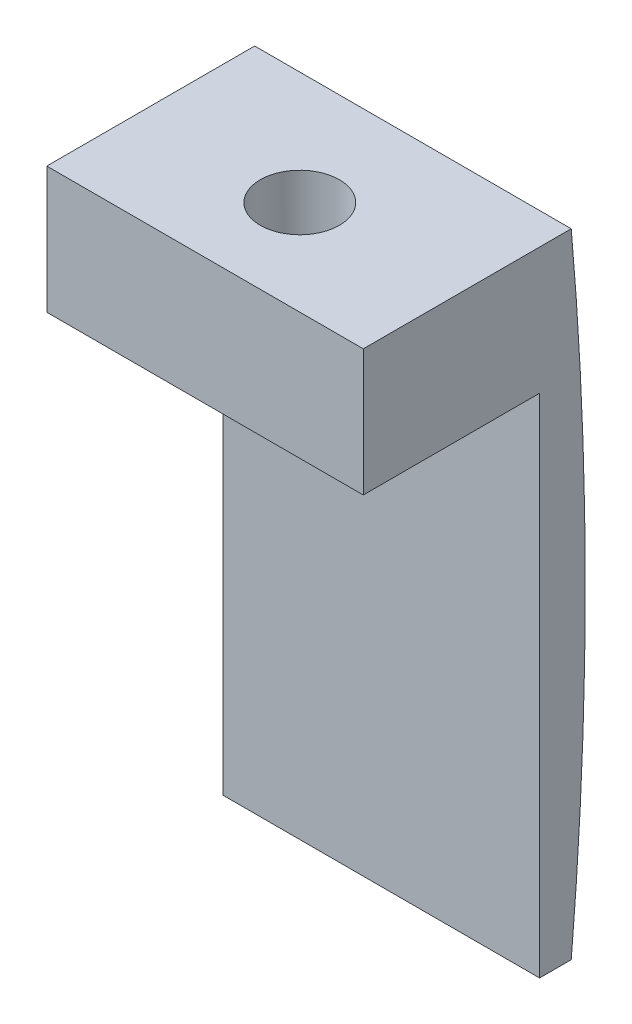
ISO-10303-21;
HEADER;
FILE_DESCRIPTION(('STEP AP214'),'2;1');
FILE_NAME('part.step','',(''),(''),'','','');
FILE_SCHEMA(('AUTOMOTIVE_DESIGN { 1 0 10303 214 1 1 1 1 }'));
ENDSEC;
DATA;
#1=APPLICATION_CONTEXT('core data for automotive mechanical design processes');
#2=APPLICATION_PROTOCOL_DEFINITION('international standard','automotive_design',2000,#1);
#3=PRODUCT_CONTEXT('',#1,'mechanical');
#4=PRODUCT('Part','Part','',(#3));
#5=PRODUCT_RELATED_PRODUCT_CATEGORY('part','',(#4));
#6=PRODUCT_DEFINITION_FORMATION('','',#4);
#7=PRODUCT_DEFINITION_CONTEXT('part definition',#1,'design');
#8=PRODUCT_DEFINITION('design','',#6,#7);
#9=PRODUCT_DEFINITION_SHAPE('','',#8);
#10=(LENGTH_UNIT() NAMED_UNIT(*) SI_UNIT(.MILLI.,.METRE.));
#11=(NAMED_UNIT(*) PLANE_ANGLE_UNIT() SI_UNIT($,.RADIAN.));
#12=(NAMED_UNIT(*) SI_UNIT($,.STERADIAN.) SOLID_ANGLE_UNIT());
#13=UNCERTAINTY_MEASURE_WITH_UNIT(LENGTH_MEASURE(1.E-05),#10,'distance_accuracy_value','');
#14=(GEOMETRIC_REPRESENTATION_CONTEXT(3) GLOBAL_UNCERTAINTY_ASSIGNED_CONTEXT((#13)) GLOBAL_UNIT_ASSIGNED_CONTEXT((#10,
#11,#12)) REPRESENTATION_CONTEXT('',''));
#15=CARTESIAN_POINT('',(0.,0.,0.));
#16=DIRECTION('',(0.,0.,1.));
#17=DIRECTION('',(1.,0.,0.));
#18=AXIS2_PLACEMENT_3D('',#15,#16,#17);
#19=CARTESIAN_POINT('',(10.,3.25815389785774,0.637092305107113));
#20=DIRECTION('',(0.,0.,-1.));
#21=DIRECTION('',(0.,1.,0.));
#22=AXIS2_PLACEMENT_3D('',#19,#20,#21);
#23=PLANE('',#22);
#24=DIRECTION('',(0.,-1.,0.));
#25=VECTOR('',#24,1.);
#26=CARTESIAN_POINT('',(0.,3.25815389785774,0.637092305107113));
#27=LINE('',#26,#25);
#28=CARTESIAN_POINT('',(0.,3.25815389785774,0.637092305107113));
#29=VERTEX_POINT('',#28);
#30=CARTESIAN_POINT('',(0.,-12.7418461021423,0.637092305107111));
#31=VERTEX_POINT('',#30);
#32=EDGE_CURVE('E116',#29,#31,#27,.T.);
#33=ORIENTED_EDGE('',*,*,#32,.T.);
#34=DIRECTION('',(-1.,0.,0.));
#35=VECTOR('',#34,1.);
#36=CARTESIAN_POINT('',(10.,-12.7418461021423,0.637092305107111));
#37=LINE('',#36,#35);
#38=CARTESIAN_POINT('',(10.,-12.7418461021423,0.637092305107111));
#39=VERTEX_POINT('',#38);
#40=EDGE_CURVE('E11',#39,#31,#37,.T.);
#41=ORIENTED_EDGE('',*,*,#40,.F.);
#42=DIRECTION('',(0.,-1.,0.));
#43=VECTOR('',#42,1.);
#44=CARTESIAN_POINT('',(10.,3.25815389785774,0.637092305107113));
#45=LINE('',#44,#43);
#46=CARTESIAN_POINT('',(10.,3.25815389785774,0.637092305107113));
#47=VERTEX_POINT('',#46);
#48=EDGE_CURVE('E125',#47,#39,#45,.T.);
#49=ORIENTED_EDGE('',*,*,#48,.F.);
#50=DIRECTION('',(-1.,0.,0.));
#51=VECTOR('',#50,1.);
#52=CARTESIAN_POINT('',(10.,3.25815389785774,0.637092305107113));
#53=LINE('',#52,#51);
#54=EDGE_CURVE('E112',#47,#29,#53,.T.);
#55=ORIENTED_EDGE('',*,*,#54,.T.);
#56=EDGE_LOOP('',(#33,#41,#49,#55));
#57=FACE_BOUND('',#56,.T.);
#58=ADVANCED_FACE('F33',(#57),#23,.F.);
#59=CARTESIAN_POINT('',(10.,-12.7418461021423,-0.362907694892889));
#60=DIRECTION('',(0.,1.,0.));
#61=DIRECTION('',(0.,0.,1.));
#62=AXIS2_PLACEMENT_3D('',#59,#60,#61);
#63=PLANE('',#62);
#64=DIRECTION('',(0.,0.,-1.));
#65=VECTOR('',#64,1.);
#66=CARTESIAN_POINT('',(0.,-12.7418461021423,-0.362907694892889));
#67=LINE('',#66,#65);
#68=CARTESIAN_POINT('',(0.,-12.7418461021423,-0.362907694892889));
#69=VERTEX_POINT('',#68);
#70=EDGE_CURVE('E119',#31,#69,#67,.T.);
#71=ORIENTED_EDGE('',*,*,#70,.T.);
#72=DIRECTION('',(-1.,0.,0.));
#73=VECTOR('',#72,1.);
#74=CARTESIAN_POINT('',(10.,-12.7418461021423,-0.362907694892889));
#75=LINE('',#74,#73);
#76=CARTESIAN_POINT('',(10.,-12.7418461021423,-0.362907694892889));
#77=VERTEX_POINT('',#76);
#78=EDGE_CURVE('E41',#77,#69,#75,.T.);
#79=ORIENTED_EDGE('',*,*,#78,.F.);
#80=DIRECTION('',(0.,0.,-1.));
#81=VECTOR('',#80,1.);
#82=CARTESIAN_POINT('',(10.,-12.7418461021423,-0.362907694892889));
#83=LINE('',#82,#81);
#84=EDGE_CURVE('E84',#39,#77,#83,.T.);
#85=ORIENTED_EDGE('',*,*,#84,.F.);
#86=ORIENTED_EDGE('',*,*,#40,.T.);
#87=EDGE_LOOP('',(#71,#79,#85,#86));
#88=FACE_BOUND('',#87,.T.);
#89=ADVANCED_FACE('F148',(#88),#63,.F.);
#90=CARTESIAN_POINT('',(10.,7.25815389785774,0.206723568871745));
#91=DIRECTION('',(0.,-1.,0.));
#92=DIRECTION('',(0.,0.,-1.));
#93=AXIS2_PLACEMENT_3D('',#90,#91,#92);
#94=PLANE('',#93);
#95=CARTESIAN_POINT('',(4.99500919662601,7.25815389785774,3.20672356887174));
#96=DIRECTION('',(0.,-1.,0.));
#97=DIRECTION('',(0.,0.,-1.));
#98=AXIS2_PLACEMENT_3D('',#95,#96,#97);
#99=CIRCLE('',#98,1.25);
#100=CARTESIAN_POINT('',(4.99500919662601,7.25815389785774,1.95672356887174));
#101=VERTEX_POINT('',#100);
#102=EDGE_CURVE('E120',#101,#101,#99,.T.);
#103=ORIENTED_EDGE('',*,*,#102,.T.);
#104=EDGE_LOOP('',(#103));
#105=FACE_BOUND('',#104,.T.);
#106=DIRECTION('',(0.,0.,1.));
#107=VECTOR('',#106,1.);
#108=CARTESIAN_POINT('',(0.,7.25815389785774,0.206723568871745));
#109=LINE('',#108,#107);
#110=CARTESIAN_POINT('',(0.,7.25815389785774,-0.362907694892886));
#111=VERTEX_POINT('',#110);
#112=CARTESIAN_POINT('',(0.,7.25815389785774,6.20672356887175));
#113=VERTEX_POINT('',#112);
#114=EDGE_CURVE('E106',#111,#113,#109,.T.);
#115=ORIENTED_EDGE('',*,*,#114,.T.);
#116=DIRECTION('',(-1.,0.,0.));
#117=VECTOR('',#116,1.);
#118=CARTESIAN_POINT('',(10.,7.25815389785774,6.20672356887175));
#119=LINE('',#118,#117);
#120=CARTESIAN_POINT('',(10.,7.25815389785774,6.20672356887175));
#121=VERTEX_POINT('',#120);
#122=EDGE_CURVE('E103',#121,#113,#119,.T.);
#123=ORIENTED_EDGE('',*,*,#122,.F.);
#124=DIRECTION('',(0.,0.,1.));
#125=VECTOR('',#124,1.);
#126=CARTESIAN_POINT('',(10.,7.25815389785774,-0.362907694892886));
#127=LINE('',#126,#125);
#128=CARTESIAN_POINT('',(10.,7.25815389785774,-0.362907694892886));
#129=VERTEX_POINT('',#128);
#130=EDGE_CURVE('E92',#129,#121,#127,.T.);
#131=ORIENTED_EDGE('',*,*,#130,.F.);
#132=DIRECTION('',(-1.,0.,0.));
#133=VECTOR('',#132,1.);
#134=CARTESIAN_POINT('',(10.,7.25815389785774,-0.362907694892886));
#135=LINE('',#134,#133);
#136=EDGE_CURVE('E107',#129,#111,#135,.T.);
#137=ORIENTED_EDGE('',*,*,#136,.T.);
#138=EDGE_LOOP('',(#115,#123,#131,#137));
#139=FACE_BOUND('',#138,.T.);
#140=ADVANCED_FACE('F104',(#105,#139),#94,.F.);
#141=CARTESIAN_POINT('',(10.,7.25815389785774,6.20672356887175));
#142=DIRECTION('',(0.,0.,-1.));
#143=DIRECTION('',(0.,1.,0.));
#144=AXIS2_PLACEMENT_3D('',#141,#142,#143);
#145=PLANE('',#144);
#146=DIRECTION('',(0.,-1.,0.));
#147=VECTOR('',#146,1.);
#148=CARTESIAN_POINT('',(0.,7.25815389785774,6.20672356887175));
#149=LINE('',#148,#147);
#150=CARTESIAN_POINT('',(0.,3.25815389785774,6.20672356887174));
#151=VERTEX_POINT('',#150);
#152=EDGE_CURVE('E70',#113,#151,#149,.T.);
#153=ORIENTED_EDGE('',*,*,#152,.T.);
#154=DIRECTION('',(-1.,0.,0.));
#155=VECTOR('',#154,1.);
#156=CARTESIAN_POINT('',(10.,3.25815389785774,6.20672356887174));
#157=LINE('',#156,#155);
#158=CARTESIAN_POINT('',(10.,3.25815389785774,6.20672356887174));
#159=VERTEX_POINT('',#158);
#160=EDGE_CURVE('E108',#159,#151,#157,.T.);
#161=ORIENTED_EDGE('',*,*,#160,.F.);
#162=DIRECTION('',(0.,-1.,0.));
#163=VECTOR('',#162,1.);
#164=CARTESIAN_POINT('',(10.,7.25815389785774,6.20672356887175));
#165=LINE('',#164,#163);
#166=EDGE_CURVE('E96',#121,#159,#165,.T.);
#167=ORIENTED_EDGE('',*,*,#166,.F.);
#168=ORIENTED_EDGE('',*,*,#122,.T.);
#169=EDGE_LOOP('',(#153,#161,#167,#168));
#170=FACE_BOUND('',#169,.T.);
#171=ADVANCED_FACE('F110',(#170),#145,.F.);
#172=CARTESIAN_POINT('',(10.,3.25815389785774,0.637092305107113));
#173=DIRECTION('',(0.,1.,0.));
#174=DIRECTION('',(0.,0.,1.));
#175=AXIS2_PLACEMENT_3D('',#172,#173,#174);
#176=PLANE('',#175);
#177=CARTESIAN_POINT('',(4.99500919662601,3.25815389785774,3.20672356887174));
#178=DIRECTION('',(0.,1.,0.));
#179=DIRECTION('',(0.,0.,1.));
#180=AXIS2_PLACEMENT_3D('',#177,#178,#179);
#181=CIRCLE('',#180,1.25);
#182=CARTESIAN_POINT('',(4.99500919662601,3.25815389785774,4.45672356887174));
#183=VERTEX_POINT('',#182);
#184=EDGE_CURVE('E138',#183,#183,#181,.T.);
#185=ORIENTED_EDGE('',*,*,#184,.T.);
#186=EDGE_LOOP('',(#185));
#187=FACE_BOUND('',#186,.T.);
#188=DIRECTION('',(0.,0.,-1.));
#189=VECTOR('',#188,1.);
#190=CARTESIAN_POINT('',(0.,3.25815389785774,0.637092305107113));
#191=LINE('',#190,#189);
#192=EDGE_CURVE('E76',#151,#29,#191,.T.);
#193=ORIENTED_EDGE('',*,*,#192,.T.);
#194=ORIENTED_EDGE('',*,*,#54,.F.);
#195=DIRECTION('',(0.,0.,-1.));
#196=VECTOR('',#195,1.);
#197=CARTESIAN_POINT('',(10.,3.25815389785774,0.637092305107113));
#198=LINE('',#197,#196);
#199=EDGE_CURVE('E49',#159,#47,#198,.T.);
#200=ORIENTED_EDGE('',*,*,#199,.F.);
#201=ORIENTED_EDGE('',*,*,#160,.T.);
#202=EDGE_LOOP('',(#193,#194,#200,#201));
#203=FACE_BOUND('',#202,.T.);
#204=ADVANCED_FACE('F159',(#187,#203),#176,.F.);
#205=CARTESIAN_POINT('',(10.,0.,0.));
#206=DIRECTION('',(-1.,0.,0.));
#207=DIRECTION('',(0.,0.,1.));
#208=AXIS2_PLACEMENT_3D('',#205,#206,#207);
#209=PLANE('',#208);
#210=ORIENTED_EDGE('',*,*,#48,.T.);
#211=ORIENTED_EDGE('',*,*,#84,.T.);
#212=CARTESIAN_POINT('',(10.,-2.74184610214227,112.40605079678));
#213=DIRECTION('',(-1.,0.,0.));
#214=DIRECTION('',(0.,0.,1.));
#215=AXIS2_PLACEMENT_3D('',#212,#213,#214);
#216=CIRCLE('',#215,113.211474680337);
#217=EDGE_CURVE('E98',#77,#129,#216,.F.);
#218=ORIENTED_EDGE('',*,*,#217,.T.);
#219=ORIENTED_EDGE('',*,*,#130,.T.);
#220=ORIENTED_EDGE('',*,*,#166,.T.);
#221=ORIENTED_EDGE('',*,*,#199,.T.);
#222=EDGE_LOOP('',(#210,#211,#218,#219,#220,#221));
#223=FACE_BOUND('',#222,.T.);
#224=ADVANCED_FACE('F94',(#223),#209,.F.);
#225=CARTESIAN_POINT('',(0.,0.,0.));
#226=DIRECTION('',(-1.,0.,0.));
#227=DIRECTION('',(0.,0.,1.));
#228=AXIS2_PLACEMENT_3D('',#225,#226,#227);
#229=PLANE('',#228);
#230=ORIENTED_EDGE('',*,*,#32,.F.);
#231=ORIENTED_EDGE('',*,*,#192,.F.);
#232=ORIENTED_EDGE('',*,*,#152,.F.);
#233=ORIENTED_EDGE('',*,*,#114,.F.);
#234=CARTESIAN_POINT('',(0.,-2.74184610214227,112.40605079678));
#235=DIRECTION('',(-1.,0.,0.));
#236=DIRECTION('',(0.,0.,1.));
#237=AXIS2_PLACEMENT_3D('',#234,#235,#236);
#238=CIRCLE('',#237,113.211474680337);
#239=EDGE_CURVE('E133',#111,#69,#238,.T.);
#240=ORIENTED_EDGE('',*,*,#239,.T.);
#241=ORIENTED_EDGE('',*,*,#70,.F.);
#242=EDGE_LOOP('',(#230,#231,#232,#233,#240,#241));
#243=FACE_BOUND('',#242,.T.);
#244=ADVANCED_FACE('F136',(#243),#229,.T.);
#245=CARTESIAN_POINT('',(4.99500919662601,10.7936878037905,3.20672356887174));
#246=DIRECTION('',(0.,-1.,0.));
#247=DIRECTION('',(0.,0.,-1.));
#248=AXIS2_PLACEMENT_3D('',#245,#246,#247);
#249=CYLINDRICAL_SURFACE('',#248,1.25);
#250=ORIENTED_EDGE('',*,*,#102,.F.);
#251=EDGE_LOOP('',(#250));
#252=FACE_BOUND('',#251,.T.);
#253=ORIENTED_EDGE('',*,*,#184,.F.);
#254=EDGE_LOOP('',(#253));
#255=FACE_BOUND('',#254,.T.);
#256=ADVANCED_FACE('F165',(#252,#255),#249,.F.);
#257=CARTESIAN_POINT('',(30.0048949154258,-2.74184610214227,112.40605079678));
#258=DIRECTION('',(-1.,0.,0.));
#259=DIRECTION('',(0.,0.,1.));
#260=AXIS2_PLACEMENT_3D('',#257,#258,#259);
#261=CYLINDRICAL_SURFACE('',#260,113.211474680337);
#262=ORIENTED_EDGE('',*,*,#217,.F.);
#263=ORIENTED_EDGE('',*,*,#78,.T.);
#264=ORIENTED_EDGE('',*,*,#239,.F.);
#265=ORIENTED_EDGE('',*,*,#136,.F.);
#266=EDGE_LOOP('',(#262,#263,#264,#265));
#267=FACE_BOUND('',#266,.T.);
#268=ADVANCED_FACE('F132',(#267),#261,.T.);
#269=CLOSED_SHELL('',(#58,#89,#140,#171,#204,#224,#244,#256,#268));
#270=MANIFOLD_SOLID_BREP('B2',#269);
#271=ADVANCED_BREP_SHAPE_REPRESENTATION('',(#18,#270),#14);
#272=SHAPE_DEFINITION_REPRESENTATION(#9,#271);
ENDSEC;
END-ISO-10303-21;
